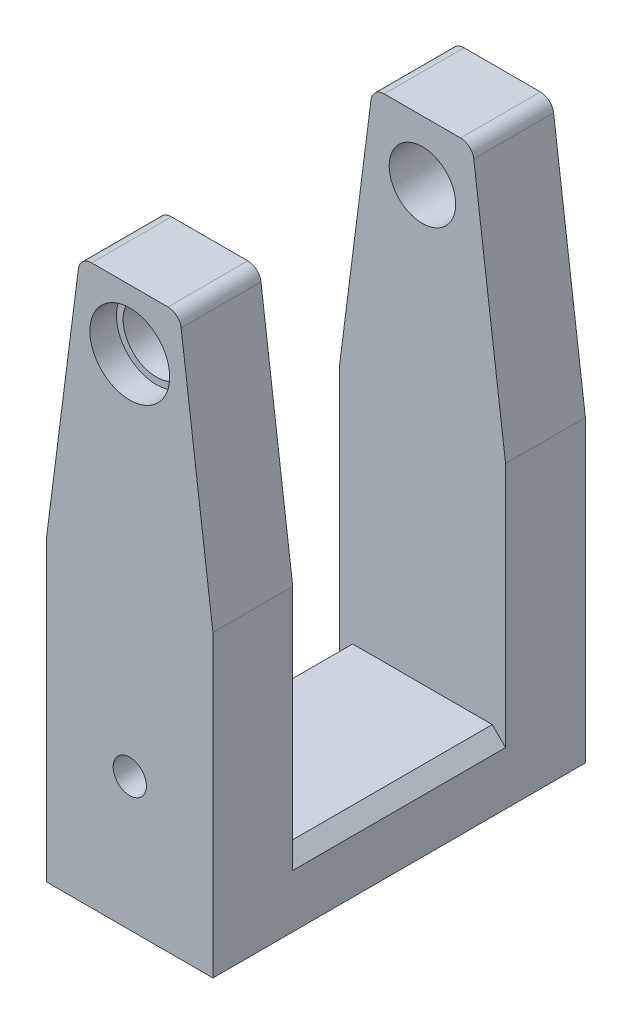
ISO-10303-21;
HEADER;
FILE_DESCRIPTION(('STEP AP214'),'2;1');
FILE_NAME('part.step','',(''),(''),'','','');
FILE_SCHEMA(('AUTOMOTIVE_DESIGN { 1 0 10303 214 1 1 1 1 }'));
ENDSEC;
DATA;
#1=APPLICATION_CONTEXT('core data for automotive mechanical design processes');
#2=APPLICATION_PROTOCOL_DEFINITION('international standard','automotive_design',2000,#1);
#3=PRODUCT_CONTEXT('',#1,'mechanical');
#4=PRODUCT('Part','Part','',(#3));
#5=PRODUCT_RELATED_PRODUCT_CATEGORY('part','',(#4));
#6=PRODUCT_DEFINITION_FORMATION('','',#4);
#7=PRODUCT_DEFINITION_CONTEXT('part definition',#1,'design');
#8=PRODUCT_DEFINITION('design','',#6,#7);
#9=PRODUCT_DEFINITION_SHAPE('','',#8);
#10=(LENGTH_UNIT() NAMED_UNIT(*) SI_UNIT(.MILLI.,.METRE.));
#11=(NAMED_UNIT(*) PLANE_ANGLE_UNIT() SI_UNIT($,.RADIAN.));
#12=(NAMED_UNIT(*) SI_UNIT($,.STERADIAN.) SOLID_ANGLE_UNIT());
#13=UNCERTAINTY_MEASURE_WITH_UNIT(LENGTH_MEASURE(1.E-05),#10,'distance_accuracy_value','');
#14=(GEOMETRIC_REPRESENTATION_CONTEXT(3) GLOBAL_UNCERTAINTY_ASSIGNED_CONTEXT((#13)) GLOBAL_UNIT_ASSIGNED_CONTEXT((#10,
#11,#12)) REPRESENTATION_CONTEXT('',''));
#15=CARTESIAN_POINT('',(0.,0.,0.));
#16=DIRECTION('',(0.,0.,1.));
#17=DIRECTION('',(1.,0.,0.));
#18=AXIS2_PLACEMENT_3D('',#15,#16,#17);
#19=CARTESIAN_POINT('',(7.5,84.,28.));
#20=DIRECTION('',(-0.991881664685851,-0.127164315985365,0.));
#21=DIRECTION('',(0.127164315985365,-0.991881664685851,0.));
#22=AXIS2_PLACEMENT_3D('',#19,#20,#21);
#23=PLANE('',#22);
#24=DIRECTION('',(-0.127164315985365,0.991881664685851,0.));
#25=VECTOR('',#24,1.);
#26=CARTESIAN_POINT('',(7.5,84.,16.));
#27=LINE('',#26,#25);
#28=CARTESIAN_POINT('',(12.5,45.,16.));
#29=VERTEX_POINT('',#28);
#30=CARTESIAN_POINT('',(7.72380402154221,82.2543286319707,16.));
#31=VERTEX_POINT('',#30);
#32=EDGE_CURVE('E348',#29,#31,#27,.T.);
#33=ORIENTED_EDGE('',*,*,#32,.T.);
#34=DIRECTION('',(0.,0.,-1.));
#35=VECTOR('',#34,1.);
#36=CARTESIAN_POINT('',(7.72380402154221,82.2543286319707,28.));
#37=LINE('',#36,#35);
#38=CARTESIAN_POINT('',(7.72380402154221,82.2543286319707,28.));
#39=VERTEX_POINT('',#38);
#40=EDGE_CURVE('E11',#31,#39,#37,.F.);
#41=ORIENTED_EDGE('',*,*,#40,.T.);
#42=DIRECTION('',(-0.127164315985365,0.99188166468585,0.));
#43=VECTOR('',#42,1.);
#44=CARTESIAN_POINT('',(7.5,84.,28.));
#45=LINE('',#44,#43);
#46=CARTESIAN_POINT('',(12.5,45.,28.));
#47=VERTEX_POINT('',#46);
#48=EDGE_CURVE('E355',#47,#39,#45,.T.);
#49=ORIENTED_EDGE('',*,*,#48,.F.);
#50=DIRECTION('',(0.,0.,-1.));
#51=VECTOR('',#50,1.);
#52=CARTESIAN_POINT('',(12.5,45.,28.));
#53=LINE('',#52,#51);
#54=EDGE_CURVE('E209',#47,#29,#53,.T.);
#55=ORIENTED_EDGE('',*,*,#54,.T.);
#56=EDGE_LOOP('',(#33,#41,#49,#55));
#57=FACE_BOUND('',#56,.T.);
#58=ADVANCED_FACE('F49',(#57),#23,.F.);
#59=CARTESIAN_POINT('',(-7.5,84.,28.));
#60=DIRECTION('',(0.,-1.,0.));
#61=DIRECTION('',(0.,0.,-1.));
#62=AXIS2_PLACEMENT_3D('',#59,#60,#61);
#63=PLANE('',#62);
#64=DIRECTION('',(1.,0.,0.));
#65=VECTOR('',#64,1.);
#66=CARTESIAN_POINT('',(-12.5,84.,16.));
#67=LINE('',#66,#65);
#68=CARTESIAN_POINT('',(-5.74004069217051,84.,16.));
#69=VERTEX_POINT('',#68);
#70=CARTESIAN_POINT('',(5.74004069217051,84.,16.));
#71=VERTEX_POINT('',#70);
#72=EDGE_CURVE('E324',#69,#71,#67,.T.);
#73=ORIENTED_EDGE('',*,*,#72,.F.);
#74=DIRECTION('',(0.,0.,-1.));
#75=VECTOR('',#74,1.);
#76=CARTESIAN_POINT('',(-5.74004069217051,84.,28.));
#77=LINE('',#76,#75);
#78=CARTESIAN_POINT('',(-5.74004069217051,84.,28.));
#79=VERTEX_POINT('',#78);
#80=EDGE_CURVE('E71',#69,#79,#77,.F.);
#81=ORIENTED_EDGE('',*,*,#80,.T.);
#82=DIRECTION('',(-1.,0.,0.));
#83=VECTOR('',#82,1.);
#84=CARTESIAN_POINT('',(-7.5,84.,28.));
#85=LINE('',#84,#83);
#86=CARTESIAN_POINT('',(5.74004069217051,84.,28.));
#87=VERTEX_POINT('',#86);
#88=EDGE_CURVE('E310',#87,#79,#85,.T.);
#89=ORIENTED_EDGE('',*,*,#88,.F.);
#90=DIRECTION('',(0.,0.,-1.));
#91=VECTOR('',#90,1.);
#92=CARTESIAN_POINT('',(5.74004069217051,84.,28.));
#93=LINE('',#92,#91);
#94=EDGE_CURVE('E295',#87,#71,#93,.T.);
#95=ORIENTED_EDGE('',*,*,#94,.T.);
#96=EDGE_LOOP('',(#73,#81,#89,#95));
#97=FACE_BOUND('',#96,.T.);
#98=ADVANCED_FACE('F326',(#97),#63,.F.);
#99=CARTESIAN_POINT('',(-12.5,45.,28.));
#100=DIRECTION('',(0.991881664685851,-0.127164315985365,0.));
#101=DIRECTION('',(0.127164315985365,0.991881664685851,0.));
#102=AXIS2_PLACEMENT_3D('',#99,#100,#101);
#103=PLANE('',#102);
#104=DIRECTION('',(-0.127164315985365,-0.99188166468585,0.));
#105=VECTOR('',#104,1.);
#106=CARTESIAN_POINT('',(-12.5,45.,28.));
#107=LINE('',#106,#105);
#108=CARTESIAN_POINT('',(-7.72380402154221,82.2543286319707,28.));
#109=VERTEX_POINT('',#108);
#110=CARTESIAN_POINT('',(-12.5,45.,28.));
#111=VERTEX_POINT('',#110);
#112=EDGE_CURVE('E308',#109,#111,#107,.T.);
#113=ORIENTED_EDGE('',*,*,#112,.F.);
#114=DIRECTION('',(0.,0.,-1.));
#115=VECTOR('',#114,1.);
#116=CARTESIAN_POINT('',(-7.72380402154221,82.2543286319707,28.));
#117=LINE('',#116,#115);
#118=CARTESIAN_POINT('',(-7.72380402154221,82.2543286319707,16.));
#119=VERTEX_POINT('',#118);
#120=EDGE_CURVE('E285',#109,#119,#117,.T.);
#121=ORIENTED_EDGE('',*,*,#120,.T.);
#122=DIRECTION('',(-0.127164315985365,-0.991881664685851,0.));
#123=VECTOR('',#122,1.);
#124=CARTESIAN_POINT('',(-12.5,45.,16.));
#125=LINE('',#124,#123);
#126=CARTESIAN_POINT('',(-12.5,45.,16.));
#127=VERTEX_POINT('',#126);
#128=EDGE_CURVE('E187',#119,#127,#125,.T.);
#129=ORIENTED_EDGE('',*,*,#128,.T.);
#130=DIRECTION('',(0.,0.,-1.));
#131=VECTOR('',#130,1.);
#132=CARTESIAN_POINT('',(-12.5,45.,28.));
#133=LINE('',#132,#131);
#134=EDGE_CURVE('E210',#111,#127,#133,.T.);
#135=ORIENTED_EDGE('',*,*,#134,.F.);
#136=EDGE_LOOP('',(#113,#121,#129,#135));
#137=FACE_BOUND('',#136,.T.);
#138=ADVANCED_FACE('F314',(#137),#103,.F.);
#139=CARTESIAN_POINT('',(12.5,0.,28.));
#140=DIRECTION('',(-1.,0.,0.));
#141=DIRECTION('',(0.,0.,1.));
#142=AXIS2_PLACEMENT_3D('',#139,#140,#141);
#143=PLANE('',#142);
#144=DIRECTION('',(0.,1.,0.));
#145=VECTOR('',#144,1.);
#146=CARTESIAN_POINT('',(12.5,84.,-16.));
#147=LINE('',#146,#145);
#148=CARTESIAN_POINT('',(12.5,7.99999999999998,-16.));
#149=VERTEX_POINT('',#148);
#150=CARTESIAN_POINT('',(12.5,45.,-16.));
#151=VERTEX_POINT('',#150);
#152=EDGE_CURVE('E191',#149,#151,#147,.T.);
#153=ORIENTED_EDGE('',*,*,#152,.F.);
#154=DIRECTION('',(0.,0.,1.));
#155=VECTOR('',#154,1.);
#156=CARTESIAN_POINT('',(12.5,7.99999999999998,28.));
#157=LINE('',#156,#155);
#158=CARTESIAN_POINT('',(12.5,7.99999999999998,16.));
#159=VERTEX_POINT('',#158);
#160=EDGE_CURVE('E245',#149,#159,#157,.T.);
#161=ORIENTED_EDGE('',*,*,#160,.T.);
#162=DIRECTION('',(0.,-1.,0.));
#163=VECTOR('',#162,1.);
#164=CARTESIAN_POINT('',(12.5,84.,16.));
#165=LINE('',#164,#163);
#166=EDGE_CURVE('E201',#29,#159,#165,.T.);
#167=ORIENTED_EDGE('',*,*,#166,.F.);
#168=ORIENTED_EDGE('',*,*,#54,.F.);
#169=DIRECTION('',(0.,1.,0.));
#170=VECTOR('',#169,1.);
#171=CARTESIAN_POINT('',(12.5,0.,28.));
#172=LINE('',#171,#170);
#173=CARTESIAN_POINT('',(12.5,0.,28.));
#174=VERTEX_POINT('',#173);
#175=EDGE_CURVE('E351',#174,#47,#172,.T.);
#176=ORIENTED_EDGE('',*,*,#175,.F.);
#177=DIRECTION('',(0.,0.,-1.));
#178=VECTOR('',#177,1.);
#179=CARTESIAN_POINT('',(12.5,0.,28.));
#180=LINE('',#179,#178);
#181=CARTESIAN_POINT('',(12.5,0.,-28.));
#182=VERTEX_POINT('',#181);
#183=EDGE_CURVE('E366',#174,#182,#180,.T.);
#184=ORIENTED_EDGE('',*,*,#183,.T.);
#185=DIRECTION('',(0.,1.,0.));
#186=VECTOR('',#185,1.);
#187=CARTESIAN_POINT('',(12.5,0.,-28.));
#188=LINE('',#187,#186);
#189=CARTESIAN_POINT('',(12.5,45.,-28.));
#190=VERTEX_POINT('',#189);
#191=EDGE_CURVE('E207',#182,#190,#188,.T.);
#192=ORIENTED_EDGE('',*,*,#191,.T.);
#193=EDGE_CURVE('E180',#151,#190,#53,.T.);
#194=ORIENTED_EDGE('',*,*,#193,.F.);
#195=EDGE_LOOP('',(#153,#161,#167,#168,#176,#184,#192,#194));
#196=FACE_BOUND('',#195,.T.);
#197=ADVANCED_FACE('F204',(#196),#143,.F.);
#198=DIRECTION('',(-0.127164315985365,0.99188166468585,0.));
#199=VECTOR('',#198,1.);
#200=CARTESIAN_POINT('',(7.5,84.,-28.));
#201=LINE('',#200,#199);
#202=CARTESIAN_POINT('',(7.72380402154221,82.2543286319707,-28.));
#203=VERTEX_POINT('',#202);
#204=EDGE_CURVE('E369',#190,#203,#201,.T.);
#205=ORIENTED_EDGE('',*,*,#204,.T.);
#206=DIRECTION('',(0.,0.,-1.));
#207=VECTOR('',#206,1.);
#208=CARTESIAN_POINT('',(7.72380402154221,82.2543286319707,28.));
#209=LINE('',#208,#207);
#210=CARTESIAN_POINT('',(7.72380402154221,82.2543286319707,-16.));
#211=VERTEX_POINT('',#210);
#212=EDGE_CURVE('E183',#203,#211,#209,.F.);
#213=ORIENTED_EDGE('',*,*,#212,.T.);
#214=DIRECTION('',(0.127164315985365,-0.991881664685851,0.));
#215=VECTOR('',#214,1.);
#216=CARTESIAN_POINT('',(7.5,84.,-16.));
#217=LINE('',#216,#215);
#218=EDGE_CURVE('E175',#211,#151,#217,.T.);
#219=ORIENTED_EDGE('',*,*,#218,.T.);
#220=ORIENTED_EDGE('',*,*,#193,.T.);
#221=EDGE_LOOP('',(#205,#213,#219,#220));
#222=FACE_BOUND('',#221,.T.);
#223=ADVANCED_FACE('F178',(#222),#23,.F.);
#224=DIRECTION('',(-1.,0.,0.));
#225=VECTOR('',#224,1.);
#226=CARTESIAN_POINT('',(-7.5,84.,-28.));
#227=LINE('',#226,#225);
#228=CARTESIAN_POINT('',(5.74004069217051,84.,-28.));
#229=VERTEX_POINT('',#228);
#230=CARTESIAN_POINT('',(-5.74004069217051,84.,-28.));
#231=VERTEX_POINT('',#230);
#232=EDGE_CURVE('E372',#229,#231,#227,.T.);
#233=ORIENTED_EDGE('',*,*,#232,.T.);
#234=DIRECTION('',(0.,0.,-1.));
#235=VECTOR('',#234,1.);
#236=CARTESIAN_POINT('',(-5.74004069217051,84.,28.));
#237=LINE('',#236,#235);
#238=CARTESIAN_POINT('',(-5.74004069217051,84.,-16.));
#239=VERTEX_POINT('',#238);
#240=EDGE_CURVE('E274',#231,#239,#237,.F.);
#241=ORIENTED_EDGE('',*,*,#240,.T.);
#242=DIRECTION('',(1.,0.,0.));
#243=VECTOR('',#242,1.);
#244=CARTESIAN_POINT('',(-12.5,84.,-16.));
#245=LINE('',#244,#243);
#246=CARTESIAN_POINT('',(5.74004069217051,84.,-16.));
#247=VERTEX_POINT('',#246);
#248=EDGE_CURVE('E329',#239,#247,#245,.T.);
#249=ORIENTED_EDGE('',*,*,#248,.T.);
#250=DIRECTION('',(0.,0.,-1.));
#251=VECTOR('',#250,1.);
#252=CARTESIAN_POINT('',(5.74004069217051,84.,28.));
#253=LINE('',#252,#251);
#254=EDGE_CURVE('E270',#247,#229,#253,.T.);
#255=ORIENTED_EDGE('',*,*,#254,.T.);
#256=EDGE_LOOP('',(#233,#241,#249,#255));
#257=FACE_BOUND('',#256,.T.);
#258=ADVANCED_FACE('F436',(#257),#63,.F.);
#259=DIRECTION('',(0.127164315985365,0.991881664685851,0.));
#260=VECTOR('',#259,1.);
#261=CARTESIAN_POINT('',(-12.5,45.,-16.));
#262=LINE('',#261,#260);
#263=CARTESIAN_POINT('',(-12.5,45.,-16.));
#264=VERTEX_POINT('',#263);
#265=CARTESIAN_POINT('',(-7.72380402154221,82.2543286319707,-16.));
#266=VERTEX_POINT('',#265);
#267=EDGE_CURVE('E188',#264,#266,#262,.T.);
#268=ORIENTED_EDGE('',*,*,#267,.T.);
#269=DIRECTION('',(0.,0.,-1.));
#270=VECTOR('',#269,1.);
#271=CARTESIAN_POINT('',(-7.72380402154221,82.2543286319707,28.));
#272=LINE('',#271,#270);
#273=CARTESIAN_POINT('',(-7.72380402154221,82.2543286319707,-28.));
#274=VERTEX_POINT('',#273);
#275=EDGE_CURVE('E260',#266,#274,#272,.T.);
#276=ORIENTED_EDGE('',*,*,#275,.T.);
#277=DIRECTION('',(-0.127164315985365,-0.99188166468585,0.));
#278=VECTOR('',#277,1.);
#279=CARTESIAN_POINT('',(-12.5,45.,-28.));
#280=LINE('',#279,#278);
#281=CARTESIAN_POINT('',(-12.5,45.,-28.));
#282=VERTEX_POINT('',#281);
#283=EDGE_CURVE('E376',#274,#282,#280,.T.);
#284=ORIENTED_EDGE('',*,*,#283,.T.);
#285=EDGE_CURVE('E217',#264,#282,#133,.T.);
#286=ORIENTED_EDGE('',*,*,#285,.F.);
#287=EDGE_LOOP('',(#268,#276,#284,#286));
#288=FACE_BOUND('',#287,.T.);
#289=ADVANCED_FACE('F443',(#288),#103,.F.);
#290=CARTESIAN_POINT('',(-12.5,0.,28.));
#291=DIRECTION('',(1.,0.,0.));
#292=DIRECTION('',(0.,0.,-1.));
#293=AXIS2_PLACEMENT_3D('',#290,#291,#292);
#294=PLANE('',#293);
#295=DIRECTION('',(0.,0.,-1.));
#296=VECTOR('',#295,1.);
#297=CARTESIAN_POINT('',(-12.5,7.99999999999999,28.));
#298=LINE('',#297,#296);
#299=CARTESIAN_POINT('',(-12.5,7.99999999999999,16.));
#300=VERTEX_POINT('',#299);
#301=CARTESIAN_POINT('',(-12.5,8.,-16.));
#302=VERTEX_POINT('',#301);
#303=EDGE_CURVE('E223',#300,#302,#298,.T.);
#304=ORIENTED_EDGE('',*,*,#303,.T.);
#305=DIRECTION('',(0.,1.,0.));
#306=VECTOR('',#305,1.);
#307=CARTESIAN_POINT('',(-12.5,84.,-16.));
#308=LINE('',#307,#306);
#309=EDGE_CURVE('E200',#302,#264,#308,.T.);
#310=ORIENTED_EDGE('',*,*,#309,.T.);
#311=ORIENTED_EDGE('',*,*,#285,.T.);
#312=DIRECTION('',(0.,-1.,0.));
#313=VECTOR('',#312,1.);
#314=CARTESIAN_POINT('',(-12.5,0.,-28.));
#315=LINE('',#314,#313);
#316=CARTESIAN_POINT('',(-12.5,0.,-28.));
#317=VERTEX_POINT('',#316);
#318=EDGE_CURVE('E379',#282,#317,#315,.T.);
#319=ORIENTED_EDGE('',*,*,#318,.T.);
#320=DIRECTION('',(0.,0.,-1.));
#321=VECTOR('',#320,1.);
#322=CARTESIAN_POINT('',(-12.5,0.,28.));
#323=LINE('',#322,#321);
#324=CARTESIAN_POINT('',(-12.5,0.,28.));
#325=VERTEX_POINT('',#324);
#326=EDGE_CURVE('E385',#325,#317,#323,.T.);
#327=ORIENTED_EDGE('',*,*,#326,.F.);
#328=DIRECTION('',(0.,-1.,0.));
#329=VECTOR('',#328,1.);
#330=CARTESIAN_POINT('',(-12.5,0.,28.));
#331=LINE('',#330,#329);
#332=EDGE_CURVE('E318',#111,#325,#331,.T.);
#333=ORIENTED_EDGE('',*,*,#332,.F.);
#334=ORIENTED_EDGE('',*,*,#134,.T.);
#335=DIRECTION('',(0.,-1.,0.));
#336=VECTOR('',#335,1.);
#337=CARTESIAN_POINT('',(-12.5,0.,16.));
#338=LINE('',#337,#336);
#339=EDGE_CURVE('E215',#127,#300,#338,.T.);
#340=ORIENTED_EDGE('',*,*,#339,.T.);
#341=EDGE_LOOP('',(#304,#310,#311,#319,#327,#333,#334,#340));
#342=FACE_BOUND('',#341,.T.);
#343=ADVANCED_FACE('F398',(#342),#294,.F.);
#344=CARTESIAN_POINT('',(-12.5,0.,28.));
#345=DIRECTION('',(0.,1.,0.));
#346=DIRECTION('',(0.,0.,1.));
#347=AXIS2_PLACEMENT_3D('',#344,#345,#346);
#348=PLANE('',#347);
#349=DIRECTION('',(1.,0.,0.));
#350=VECTOR('',#349,1.);
#351=CARTESIAN_POINT('',(-12.5,0.,-28.));
#352=LINE('',#351,#350);
#353=EDGE_CURVE('E356',#317,#182,#352,.T.);
#354=ORIENTED_EDGE('',*,*,#353,.T.);
#355=ORIENTED_EDGE('',*,*,#183,.F.);
#356=DIRECTION('',(1.,0.,0.));
#357=VECTOR('',#356,1.);
#358=CARTESIAN_POINT('',(-12.5,0.,28.));
#359=LINE('',#358,#357);
#360=EDGE_CURVE('E363',#325,#174,#359,.T.);
#361=ORIENTED_EDGE('',*,*,#360,.F.);
#362=ORIENTED_EDGE('',*,*,#326,.T.);
#363=EDGE_LOOP('',(#354,#355,#361,#362));
#364=FACE_BOUND('',#363,.T.);
#365=ADVANCED_FACE('F404',(#364),#348,.F.);
#366=CARTESIAN_POINT('',(0.,0.,28.));
#367=DIRECTION('',(0.,0.,-1.));
#368=DIRECTION('',(-1.,0.,0.));
#369=AXIS2_PLACEMENT_3D('',#366,#367,#368);
#370=PLANE('',#369);
#371=CARTESIAN_POINT('',(0.,20.,28.));
#372=DIRECTION('',(0.,0.,1.));
#373=DIRECTION('',(1.,0.,0.));
#374=AXIS2_PLACEMENT_3D('',#371,#372,#373);
#375=CIRCLE('',#374,2.5);
#376=CARTESIAN_POINT('',(2.5,20.,28.));
#377=VERTEX_POINT('',#376);
#378=EDGE_CURVE('E527',#377,#377,#375,.T.);
#379=ORIENTED_EDGE('',*,*,#378,.F.);
#380=EDGE_LOOP('',(#379));
#381=FACE_BOUND('',#380,.T.);
#382=CARTESIAN_POINT('',(0.,75.,28.));
#383=DIRECTION('',(0.,0.,1.));
#384=DIRECTION('',(1.,0.,0.));
#385=AXIS2_PLACEMENT_3D('',#382,#383,#384);
#386=CIRCLE('',#385,6.);
#387=CARTESIAN_POINT('',(6.,75.,28.));
#388=VERTEX_POINT('',#387);
#389=EDGE_CURVE('E233',#388,#388,#386,.T.);
#390=ORIENTED_EDGE('',*,*,#389,.F.);
#391=EDGE_LOOP('',(#390));
#392=FACE_BOUND('',#391,.T.);
#393=ORIENTED_EDGE('',*,*,#88,.T.);
#394=CARTESIAN_POINT('',(-5.74004069217051,82.,28.));
#395=DIRECTION('',(0.,0.,-1.));
#396=DIRECTION('',(-1.,0.,0.));
#397=AXIS2_PLACEMENT_3D('',#394,#395,#396);
#398=CIRCLE('',#397,2.);
#399=EDGE_CURVE('E58',#79,#109,#398,.F.);
#400=ORIENTED_EDGE('',*,*,#399,.T.);
#401=ORIENTED_EDGE('',*,*,#112,.T.);
#402=ORIENTED_EDGE('',*,*,#332,.T.);
#403=ORIENTED_EDGE('',*,*,#360,.T.);
#404=ORIENTED_EDGE('',*,*,#175,.T.);
#405=ORIENTED_EDGE('',*,*,#48,.T.);
#406=CARTESIAN_POINT('',(5.74004069217051,82.,28.));
#407=DIRECTION('',(0.,0.,-1.));
#408=DIRECTION('',(-1.,0.,0.));
#409=AXIS2_PLACEMENT_3D('',#406,#407,#408);
#410=CIRCLE('',#409,2.);
#411=EDGE_CURVE('E301',#39,#87,#410,.F.);
#412=ORIENTED_EDGE('',*,*,#411,.T.);
#413=EDGE_LOOP('',(#393,#400,#401,#402,#403,#404,#405,#412));
#414=FACE_BOUND('',#413,.T.);
#415=ADVANCED_FACE('F307',(#381,#392,#414),#370,.F.);
#416=CARTESIAN_POINT('',(0.,0.,-28.));
#417=DIRECTION('',(0.,0.,-1.));
#418=DIRECTION('',(-1.,0.,0.));
#419=AXIS2_PLACEMENT_3D('',#416,#417,#418);
#420=PLANE('',#419);
#421=CARTESIAN_POINT('',(0.,75.,-28.));
#422=DIRECTION('',(0.,0.,-1.));
#423=DIRECTION('',(-1.,0.,0.));
#424=AXIS2_PLACEMENT_3D('',#421,#422,#423);
#425=CIRCLE('',#424,6.);
#426=CARTESIAN_POINT('',(-6.,75.,-28.));
#427=VERTEX_POINT('',#426);
#428=EDGE_CURVE('E532',#427,#427,#425,.T.);
#429=ORIENTED_EDGE('',*,*,#428,.F.);
#430=EDGE_LOOP('',(#429));
#431=FACE_BOUND('',#430,.T.);
#432=ORIENTED_EDGE('',*,*,#283,.F.);
#433=CARTESIAN_POINT('',(-5.74004069217051,82.,-28.));
#434=DIRECTION('',(0.,0.,-1.));
#435=DIRECTION('',(-1.,0.,0.));
#436=AXIS2_PLACEMENT_3D('',#433,#434,#435);
#437=CIRCLE('',#436,2.);
#438=EDGE_CURVE('E267',#274,#231,#437,.T.);
#439=ORIENTED_EDGE('',*,*,#438,.T.);
#440=ORIENTED_EDGE('',*,*,#232,.F.);
#441=CARTESIAN_POINT('',(5.74004069217051,82.,-28.));
#442=DIRECTION('',(0.,0.,-1.));
#443=DIRECTION('',(-1.,0.,0.));
#444=AXIS2_PLACEMENT_3D('',#441,#442,#443);
#445=CIRCLE('',#444,2.);
#446=EDGE_CURVE('E264',#229,#203,#445,.T.);
#447=ORIENTED_EDGE('',*,*,#446,.T.);
#448=ORIENTED_EDGE('',*,*,#204,.F.);
#449=ORIENTED_EDGE('',*,*,#191,.F.);
#450=ORIENTED_EDGE('',*,*,#353,.F.);
#451=ORIENTED_EDGE('',*,*,#318,.F.);
#452=EDGE_LOOP('',(#432,#439,#440,#447,#448,#449,#450,#451));
#453=FACE_BOUND('',#452,.T.);
#454=ADVANCED_FACE('F402',(#431,#453),#420,.T.);
#455=CARTESIAN_POINT('',(-12.5,84.,16.));
#456=DIRECTION('',(0.,0.,1.));
#457=DIRECTION('',(0.,-1.,0.));
#458=AXIS2_PLACEMENT_3D('',#455,#456,#457);
#459=PLANE('',#458);
#460=CARTESIAN_POINT('',(0.,20.,16.));
#461=DIRECTION('',(0.,0.,1.));
#462=DIRECTION('',(0.,-1.,0.));
#463=AXIS2_PLACEMENT_3D('',#460,#461,#462);
#464=CIRCLE('',#463,2.5);
#465=CARTESIAN_POINT('',(0.,17.5,16.));
#466=VERTEX_POINT('',#465);
#467=EDGE_CURVE('E530',#466,#466,#464,.T.);
#468=ORIENTED_EDGE('',*,*,#467,.T.);
#469=EDGE_LOOP('',(#468));
#470=FACE_BOUND('',#469,.T.);
#471=CARTESIAN_POINT('',(0.,75.,16.));
#472=DIRECTION('',(0.,0.,1.));
#473=DIRECTION('',(0.,-1.,0.));
#474=AXIS2_PLACEMENT_3D('',#471,#472,#473);
#475=CIRCLE('',#474,5.);
#476=CARTESIAN_POINT('',(0.,70.,16.));
#477=VERTEX_POINT('',#476);
#478=EDGE_CURVE('E224',#477,#477,#475,.T.);
#479=ORIENTED_EDGE('',*,*,#478,.T.);
#480=EDGE_LOOP('',(#479));
#481=FACE_BOUND('',#480,.T.);
#482=ORIENTED_EDGE('',*,*,#128,.F.);
#483=CARTESIAN_POINT('',(-5.74004069217051,82.,16.));
#484=DIRECTION('',(0.,0.,1.));
#485=DIRECTION('',(0.,-1.,0.));
#486=AXIS2_PLACEMENT_3D('',#483,#484,#485);
#487=CIRCLE('',#486,2.);
#488=EDGE_CURVE('E292',#119,#69,#487,.F.);
#489=ORIENTED_EDGE('',*,*,#488,.T.);
#490=ORIENTED_EDGE('',*,*,#72,.T.);
#491=CARTESIAN_POINT('',(5.74004069217051,82.,16.));
#492=DIRECTION('',(0.,0.,1.));
#493=DIRECTION('',(0.,-1.,0.));
#494=AXIS2_PLACEMENT_3D('',#491,#492,#493);
#495=CIRCLE('',#494,2.);
#496=EDGE_CURVE('E289',#71,#31,#495,.F.);
#497=ORIENTED_EDGE('',*,*,#496,.T.);
#498=ORIENTED_EDGE('',*,*,#32,.F.);
#499=ORIENTED_EDGE('',*,*,#166,.T.);
#500=DIRECTION('',(0.707106781186545,-0.70710678118655,0.));
#501=VECTOR('',#500,1.);
#502=CARTESIAN_POINT('',(-37.9999999999999,58.5000000000002,16.));
#503=LINE('',#502,#501);
#504=CARTESIAN_POINT('',(10.5,9.99999999999999,16.));
#505=VERTEX_POINT('',#504);
#506=EDGE_CURVE('E257',#159,#505,#503,.F.);
#507=ORIENTED_EDGE('',*,*,#506,.T.);
#508=DIRECTION('',(1.,0.,0.));
#509=VECTOR('',#508,1.);
#510=CARTESIAN_POINT('',(-12.5,9.99999999999999,16.));
#511=LINE('',#510,#509);
#512=CARTESIAN_POINT('',(-10.5,9.99999999999999,16.));
#513=VERTEX_POINT('',#512);
#514=EDGE_CURVE('E342',#513,#505,#511,.T.);
#515=ORIENTED_EDGE('',*,*,#514,.F.);
#516=DIRECTION('',(0.707106781186548,0.707106781186547,0.));
#517=VECTOR('',#516,1.);
#518=CARTESIAN_POINT('',(25.5,46.,16.));
#519=LINE('',#518,#517);
#520=EDGE_CURVE('E251',#513,#300,#519,.F.);
#521=ORIENTED_EDGE('',*,*,#520,.T.);
#522=ORIENTED_EDGE('',*,*,#339,.F.);
#523=EDGE_LOOP('',(#482,#489,#490,#497,#498,#499,#507,#515,#521,#522));
#524=FACE_BOUND('',#523,.T.);
#525=ADVANCED_FACE('F323',(#470,#481,#524),#459,.F.);
#526=CARTESIAN_POINT('',(-12.5,84.,-16.));
#527=DIRECTION('',(0.,0.,-1.));
#528=DIRECTION('',(0.,1.,0.));
#529=AXIS2_PLACEMENT_3D('',#526,#527,#528);
#530=PLANE('',#529);
#531=CARTESIAN_POINT('',(0.,75.,-16.));
#532=DIRECTION('',(0.,0.,-1.));
#533=DIRECTION('',(0.,1.,0.));
#534=AXIS2_PLACEMENT_3D('',#531,#532,#533);
#535=CIRCLE('',#534,5.);
#536=CARTESIAN_POINT('',(0.,80.,-16.));
#537=VERTEX_POINT('',#536);
#538=EDGE_CURVE('E229',#537,#537,#535,.T.);
#539=ORIENTED_EDGE('',*,*,#538,.T.);
#540=EDGE_LOOP('',(#539));
#541=FACE_BOUND('',#540,.T.);
#542=ORIENTED_EDGE('',*,*,#248,.F.);
#543=CARTESIAN_POINT('',(-5.74004069217051,82.,-16.));
#544=DIRECTION('',(0.,0.,-1.));
#545=DIRECTION('',(0.,1.,0.));
#546=AXIS2_PLACEMENT_3D('',#543,#544,#545);
#547=CIRCLE('',#546,2.);
#548=EDGE_CURVE('E280',#239,#266,#547,.F.);
#549=ORIENTED_EDGE('',*,*,#548,.T.);
#550=ORIENTED_EDGE('',*,*,#267,.F.);
#551=ORIENTED_EDGE('',*,*,#309,.F.);
#552=DIRECTION('',(-0.707106781186548,-0.707106781186547,0.));
#553=VECTOR('',#552,1.);
#554=CARTESIAN_POINT('',(25.5,46.,-16.));
#555=LINE('',#554,#553);
#556=CARTESIAN_POINT('',(-10.5,10.,-16.));
#557=VERTEX_POINT('',#556);
#558=EDGE_CURVE('E248',#302,#557,#555,.F.);
#559=ORIENTED_EDGE('',*,*,#558,.T.);
#560=DIRECTION('',(1.,0.,0.));
#561=VECTOR('',#560,1.);
#562=CARTESIAN_POINT('',(-12.5,10.,-16.));
#563=LINE('',#562,#561);
#564=CARTESIAN_POINT('',(10.5,10.,-16.));
#565=VERTEX_POINT('',#564);
#566=EDGE_CURVE('E336',#557,#565,#563,.T.);
#567=ORIENTED_EDGE('',*,*,#566,.T.);
#568=DIRECTION('',(-0.707106781186545,0.70710678118655,0.));
#569=VECTOR('',#568,1.);
#570=CARTESIAN_POINT('',(-37.9999999999999,58.5000000000003,-16.));
#571=LINE('',#570,#569);
#572=EDGE_CURVE('E195',#565,#149,#571,.F.);
#573=ORIENTED_EDGE('',*,*,#572,.T.);
#574=ORIENTED_EDGE('',*,*,#152,.T.);
#575=ORIENTED_EDGE('',*,*,#218,.F.);
#576=CARTESIAN_POINT('',(5.74004069217051,82.,-16.));
#577=DIRECTION('',(0.,0.,-1.));
#578=DIRECTION('',(0.,1.,0.));
#579=AXIS2_PLACEMENT_3D('',#576,#577,#578);
#580=CIRCLE('',#579,2.);
#581=EDGE_CURVE('E277',#211,#247,#580,.F.);
#582=ORIENTED_EDGE('',*,*,#581,.T.);
#583=EDGE_LOOP('',(#542,#549,#550,#551,#559,#567,#573,#574,#575,#582));
#584=FACE_BOUND('',#583,.T.);
#585=ADVANCED_FACE('F193',(#541,#584),#530,.F.);
#586=CARTESIAN_POINT('',(-12.5,9.99999999999999,16.));
#587=DIRECTION('',(0.,-1.,0.));
#588=DIRECTION('',(0.,0.,-1.));
#589=AXIS2_PLACEMENT_3D('',#586,#587,#588);
#590=PLANE('',#589);
#591=ORIENTED_EDGE('',*,*,#566,.F.);
#592=DIRECTION('',(0.,0.,1.));
#593=VECTOR('',#592,1.);
#594=CARTESIAN_POINT('',(-10.5,9.99999999999999,16.));
#595=LINE('',#594,#593);
#596=EDGE_CURVE('E242',#557,#513,#595,.T.);
#597=ORIENTED_EDGE('',*,*,#596,.T.);
#598=ORIENTED_EDGE('',*,*,#514,.T.);
#599=DIRECTION('',(0.,0.,-1.));
#600=VECTOR('',#599,1.);
#601=CARTESIAN_POINT('',(10.5,9.99999999999999,16.));
#602=LINE('',#601,#600);
#603=EDGE_CURVE('E238',#505,#565,#602,.T.);
#604=ORIENTED_EDGE('',*,*,#603,.T.);
#605=EDGE_LOOP('',(#591,#597,#598,#604));
#606=FACE_BOUND('',#605,.T.);
#607=ADVANCED_FACE('F418',(#606),#590,.F.);
#608=CARTESIAN_POINT('',(0.,75.,28.));
#609=DIRECTION('',(0.,0.,1.));
#610=DIRECTION('',(1.,0.,0.));
#611=AXIS2_PLACEMENT_3D('',#608,#609,#610);
#612=CYLINDRICAL_SURFACE('',#611,5.);
#613=CARTESIAN_POINT('',(0.,75.,24.));
#614=DIRECTION('',(0.,0.,1.));
#615=DIRECTION('',(1.,0.,0.));
#616=AXIS2_PLACEMENT_3D('',#613,#614,#615);
#617=CIRCLE('',#616,5.);
#618=CARTESIAN_POINT('',(5.,75.,24.));
#619=VERTEX_POINT('',#618);
#620=EDGE_CURVE('E228',#619,#619,#617,.T.);
#621=ORIENTED_EDGE('',*,*,#620,.T.);
#622=EDGE_LOOP('',(#621));
#623=FACE_BOUND('',#622,.T.);
#624=ORIENTED_EDGE('',*,*,#478,.F.);
#625=EDGE_LOOP('',(#624));
#626=FACE_BOUND('',#625,.T.);
#627=ADVANCED_FACE('F493',(#623,#626),#612,.F.);
#628=CARTESIAN_POINT('',(5.,75.,24.));
#629=DIRECTION('',(0.,0.,-1.));
#630=DIRECTION('',(-1.,0.,0.));
#631=AXIS2_PLACEMENT_3D('',#628,#629,#630);
#632=PLANE('',#631);
#633=ORIENTED_EDGE('',*,*,#620,.F.);
#634=EDGE_LOOP('',(#633));
#635=FACE_BOUND('',#634,.T.);
#636=CARTESIAN_POINT('',(0.,75.,24.));
#637=DIRECTION('',(0.,0.,1.));
#638=DIRECTION('',(1.,0.,0.));
#639=AXIS2_PLACEMENT_3D('',#636,#637,#638);
#640=CIRCLE('',#639,6.);
#641=CARTESIAN_POINT('',(6.,75.,24.));
#642=VERTEX_POINT('',#641);
#643=EDGE_CURVE('E550',#642,#642,#640,.T.);
#644=ORIENTED_EDGE('',*,*,#643,.T.);
#645=EDGE_LOOP('',(#644));
#646=FACE_BOUND('',#645,.T.);
#647=ADVANCED_FACE('F499',(#635,#646),#632,.F.);
#648=CARTESIAN_POINT('',(0.,75.,28.));
#649=DIRECTION('',(0.,0.,1.));
#650=DIRECTION('',(1.,0.,0.));
#651=AXIS2_PLACEMENT_3D('',#648,#649,#650);
#652=CYLINDRICAL_SURFACE('',#651,6.);
#653=ORIENTED_EDGE('',*,*,#643,.F.);
#654=EDGE_LOOP('',(#653));
#655=FACE_BOUND('',#654,.T.);
#656=ORIENTED_EDGE('',*,*,#389,.T.);
#657=EDGE_LOOP('',(#656));
#658=FACE_BOUND('',#657,.T.);
#659=ADVANCED_FACE('F503',(#655,#658),#652,.F.);
#660=CARTESIAN_POINT('',(0.,75.,-28.));
#661=DIRECTION('',(0.,0.,-1.));
#662=DIRECTION('',(-1.,0.,0.));
#663=AXIS2_PLACEMENT_3D('',#660,#661,#662);
#664=CYLINDRICAL_SURFACE('',#663,5.);
#665=CARTESIAN_POINT('',(0.,75.,-24.));
#666=DIRECTION('',(0.,0.,-1.));
#667=DIRECTION('',(-1.,0.,0.));
#668=AXIS2_PLACEMENT_3D('',#665,#666,#667);
#669=CIRCLE('',#668,5.);
#670=CARTESIAN_POINT('',(-5.,75.,-24.));
#671=VERTEX_POINT('',#670);
#672=EDGE_CURVE('E234',#671,#671,#669,.T.);
#673=ORIENTED_EDGE('',*,*,#672,.T.);
#674=EDGE_LOOP('',(#673));
#675=FACE_BOUND('',#674,.T.);
#676=ORIENTED_EDGE('',*,*,#538,.F.);
#677=EDGE_LOOP('',(#676));
#678=FACE_BOUND('',#677,.T.);
#679=ADVANCED_FACE('F507',(#675,#678),#664,.F.);
#680=CARTESIAN_POINT('',(5.,75.,-24.));
#681=DIRECTION('',(0.,0.,1.));
#682=DIRECTION('',(1.,0.,0.));
#683=AXIS2_PLACEMENT_3D('',#680,#681,#682);
#684=PLANE('',#683);
#685=ORIENTED_EDGE('',*,*,#672,.F.);
#686=EDGE_LOOP('',(#685));
#687=FACE_BOUND('',#686,.T.);
#688=CARTESIAN_POINT('',(0.,75.,-24.));
#689=DIRECTION('',(0.,0.,-1.));
#690=DIRECTION('',(-1.,0.,0.));
#691=AXIS2_PLACEMENT_3D('',#688,#689,#690);
#692=CIRCLE('',#691,6.);
#693=CARTESIAN_POINT('',(-6.,75.,-24.));
#694=VERTEX_POINT('',#693);
#695=EDGE_CURVE('E537',#694,#694,#692,.T.);
#696=ORIENTED_EDGE('',*,*,#695,.T.);
#697=EDGE_LOOP('',(#696));
#698=FACE_BOUND('',#697,.T.);
#699=ADVANCED_FACE('F511',(#687,#698),#684,.F.);
#700=CARTESIAN_POINT('',(0.,75.,-28.));
#701=DIRECTION('',(0.,0.,-1.));
#702=DIRECTION('',(-1.,0.,0.));
#703=AXIS2_PLACEMENT_3D('',#700,#701,#702);
#704=CYLINDRICAL_SURFACE('',#703,6.);
#705=ORIENTED_EDGE('',*,*,#695,.F.);
#706=EDGE_LOOP('',(#705));
#707=FACE_BOUND('',#706,.T.);
#708=ORIENTED_EDGE('',*,*,#428,.T.);
#709=EDGE_LOOP('',(#708));
#710=FACE_BOUND('',#709,.T.);
#711=ADVANCED_FACE('F515',(#707,#710),#704,.F.);
#712=CARTESIAN_POINT('',(0.,20.,28.));
#713=DIRECTION('',(0.,0.,1.));
#714=DIRECTION('',(1.,0.,0.));
#715=AXIS2_PLACEMENT_3D('',#712,#713,#714);
#716=CYLINDRICAL_SURFACE('',#715,2.5);
#717=ORIENTED_EDGE('',*,*,#378,.T.);
#718=EDGE_LOOP('',(#717));
#719=FACE_BOUND('',#718,.T.);
#720=ORIENTED_EDGE('',*,*,#467,.F.);
#721=EDGE_LOOP('',(#720));
#722=FACE_BOUND('',#721,.T.);
#723=ADVANCED_FACE('F456',(#719,#722),#716,.F.);
#724=CARTESIAN_POINT('',(-12.5,7.99999999999999,28.));
#725=DIRECTION('',(0.707106781186547,-0.707106781186548,0.));
#726=DIRECTION('',(0.,0.,-1.));
#727=AXIS2_PLACEMENT_3D('',#724,#725,#726);
#728=PLANE('',#727);
#729=ORIENTED_EDGE('',*,*,#520,.F.);
#730=ORIENTED_EDGE('',*,*,#596,.F.);
#731=ORIENTED_EDGE('',*,*,#558,.F.);
#732=ORIENTED_EDGE('',*,*,#303,.F.);
#733=EDGE_LOOP('',(#729,#730,#731,#732));
#734=FACE_BOUND('',#733,.T.);
#735=ADVANCED_FACE('F415',(#734),#728,.F.);
#736=CARTESIAN_POINT('',(10.5,9.99999999999999,16.));
#737=DIRECTION('',(-0.70710678118655,-0.707106781186545,0.));
#738=DIRECTION('',(0.,0.,-1.));
#739=AXIS2_PLACEMENT_3D('',#736,#737,#738);
#740=PLANE('',#739);
#741=ORIENTED_EDGE('',*,*,#506,.F.);
#742=ORIENTED_EDGE('',*,*,#160,.F.);
#743=ORIENTED_EDGE('',*,*,#572,.F.);
#744=ORIENTED_EDGE('',*,*,#603,.F.);
#745=EDGE_LOOP('',(#741,#742,#743,#744));
#746=FACE_BOUND('',#745,.T.);
#747=ADVANCED_FACE('F422',(#746),#740,.F.);
#748=CARTESIAN_POINT('',(-5.74004069217051,82.,28.));
#749=DIRECTION('',(0.,0.,-1.));
#750=DIRECTION('',(-1.,0.,0.));
#751=AXIS2_PLACEMENT_3D('',#748,#749,#750);
#752=CYLINDRICAL_SURFACE('',#751,2.);
#753=ORIENTED_EDGE('',*,*,#548,.F.);
#754=ORIENTED_EDGE('',*,*,#240,.F.);
#755=ORIENTED_EDGE('',*,*,#438,.F.);
#756=ORIENTED_EDGE('',*,*,#275,.F.);
#757=EDGE_LOOP('',(#753,#754,#755,#756));
#758=FACE_BOUND('',#757,.T.);
#759=ADVANCED_FACE('F461',(#758),#752,.T.);
#760=CARTESIAN_POINT('',(5.74004069217051,82.,28.));
#761=DIRECTION('',(0.,0.,-1.));
#762=DIRECTION('',(-1.,0.,0.));
#763=AXIS2_PLACEMENT_3D('',#760,#761,#762);
#764=CYLINDRICAL_SURFACE('',#763,2.);
#765=ORIENTED_EDGE('',*,*,#581,.F.);
#766=ORIENTED_EDGE('',*,*,#212,.F.);
#767=ORIENTED_EDGE('',*,*,#446,.F.);
#768=ORIENTED_EDGE('',*,*,#254,.F.);
#769=EDGE_LOOP('',(#765,#766,#767,#768));
#770=FACE_BOUND('',#769,.T.);
#771=ADVANCED_FACE('F429',(#770),#764,.T.);
#772=CARTESIAN_POINT('',(-5.74004069217051,82.,28.));
#773=DIRECTION('',(0.,0.,-1.));
#774=DIRECTION('',(-1.,0.,0.));
#775=AXIS2_PLACEMENT_3D('',#772,#773,#774);
#776=CYLINDRICAL_SURFACE('',#775,2.);
#777=ORIENTED_EDGE('',*,*,#399,.F.);
#778=ORIENTED_EDGE('',*,*,#80,.F.);
#779=ORIENTED_EDGE('',*,*,#488,.F.);
#780=ORIENTED_EDGE('',*,*,#120,.F.);
#781=EDGE_LOOP('',(#777,#778,#779,#780));
#782=FACE_BOUND('',#781,.T.);
#783=ADVANCED_FACE('F320',(#782),#776,.T.);
#784=CARTESIAN_POINT('',(5.74004069217051,82.,28.));
#785=DIRECTION('',(0.,0.,-1.));
#786=DIRECTION('',(-1.,0.,0.));
#787=AXIS2_PLACEMENT_3D('',#784,#785,#786);
#788=CYLINDRICAL_SURFACE('',#787,2.);
#789=ORIENTED_EDGE('',*,*,#411,.F.);
#790=ORIENTED_EDGE('',*,*,#40,.F.);
#791=ORIENTED_EDGE('',*,*,#496,.F.);
#792=ORIENTED_EDGE('',*,*,#94,.F.);
#793=EDGE_LOOP('',(#789,#790,#791,#792));
#794=FACE_BOUND('',#793,.T.);
#795=ADVANCED_FACE('F51',(#794),#788,.T.);
#796=CLOSED_SHELL('',(#58,#98,#138,#197,#223,#258,#289,#343,#365,#415,#454,#525,#585,#607,#627,
#647,#659,#679,#699,#711,#723,#735,#747,#759,#771,#783,#795));
#797=MANIFOLD_SOLID_BREP('B2',#796);
#798=ADVANCED_BREP_SHAPE_REPRESENTATION('',(#18,#797),#14);
#799=SHAPE_DEFINITION_REPRESENTATION(#9,#798);
ENDSEC;
END-ISO-10303-21;
